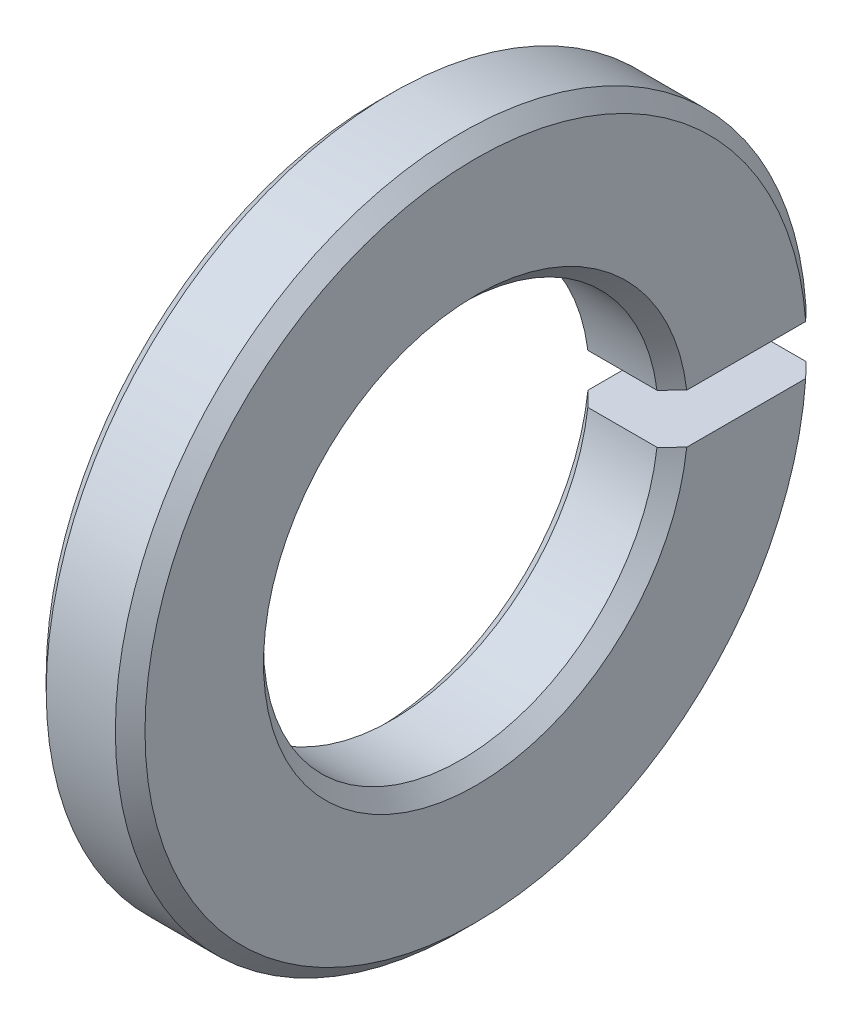
ISO-10303-21;
HEADER;
FILE_DESCRIPTION(('STEP AP214'),'2;1');
FILE_NAME('part.step','',(''),(''),'','','');
FILE_SCHEMA(('AUTOMOTIVE_DESIGN { 1 0 10303 214 1 1 1 1 }'));
ENDSEC;
DATA;
#1=APPLICATION_CONTEXT('core data for automotive mechanical design processes');
#2=APPLICATION_PROTOCOL_DEFINITION('international standard','automotive_design',2000,#1);
#3=PRODUCT_CONTEXT('',#1,'mechanical');
#4=PRODUCT('Part','Part','',(#3));
#5=PRODUCT_RELATED_PRODUCT_CATEGORY('part','',(#4));
#6=PRODUCT_DEFINITION_FORMATION('','',#4);
#7=PRODUCT_DEFINITION_CONTEXT('part definition',#1,'design');
#8=PRODUCT_DEFINITION('design','',#6,#7);
#9=PRODUCT_DEFINITION_SHAPE('','',#8);
#10=(LENGTH_UNIT() NAMED_UNIT(*) SI_UNIT(.MILLI.,.METRE.));
#11=(NAMED_UNIT(*) PLANE_ANGLE_UNIT() SI_UNIT($,.RADIAN.));
#12=(NAMED_UNIT(*) SI_UNIT($,.STERADIAN.) SOLID_ANGLE_UNIT());
#13=UNCERTAINTY_MEASURE_WITH_UNIT(LENGTH_MEASURE(1.E-05),#10,'distance_accuracy_value','');
#14=(GEOMETRIC_REPRESENTATION_CONTEXT(3) GLOBAL_UNCERTAINTY_ASSIGNED_CONTEXT((#13)) GLOBAL_UNIT_ASSIGNED_CONTEXT((#10,
#11,#12)) REPRESENTATION_CONTEXT('',''));
#15=CARTESIAN_POINT('',(0.,0.,0.));
#16=DIRECTION('',(0.,0.,1.));
#17=DIRECTION('',(1.,0.,0.));
#18=AXIS2_PLACEMENT_3D('',#15,#16,#17);
#19=CARTESIAN_POINT('',(2.,0.,0.));
#20=DIRECTION('',(-1.,0.,0.));
#21=DIRECTION('',(0.,0.,1.));
#22=AXIS2_PLACEMENT_3D('',#19,#20,#21);
#23=CYLINDRICAL_SURFACE('',#22,7.);
#24=DIRECTION('',(-1.,0.,0.));
#25=VECTOR('',#24,1.);
#26=CARTESIAN_POINT('',(2.,0.5,-6.98212002188447));
#27=LINE('',#26,#25);
#28=CARTESIAN_POINT('',(1.7,0.5,-6.98212002188447));
#29=VERTEX_POINT('',#28);
#30=CARTESIAN_POINT('',(0.300000000000002,0.5,-6.98212002188447));
#31=VERTEX_POINT('',#30);
#32=EDGE_CURVE('E123',#29,#31,#27,.T.);
#33=ORIENTED_EDGE('',*,*,#32,.T.);
#34=CARTESIAN_POINT('',(0.300000000000002,0.,0.));
#35=DIRECTION('',(1.,0.,0.));
#36=DIRECTION('',(0.,0.,-1.));
#37=AXIS2_PLACEMENT_3D('',#34,#35,#36);
#38=CIRCLE('',#37,7.);
#39=CARTESIAN_POINT('',(0.300000000000002,-0.5,-6.98212002188447));
#40=VERTEX_POINT('',#39);
#41=EDGE_CURVE('E11',#31,#40,#38,.T.);
#42=ORIENTED_EDGE('',*,*,#41,.T.);
#43=DIRECTION('',(-1.,0.,0.));
#44=VECTOR('',#43,1.);
#45=CARTESIAN_POINT('',(2.,-0.5,-6.98212002188447));
#46=LINE('',#45,#44);
#47=CARTESIAN_POINT('',(1.7,-0.5,-6.98212002188447));
#48=VERTEX_POINT('',#47);
#49=EDGE_CURVE('E128',#48,#40,#46,.T.);
#50=ORIENTED_EDGE('',*,*,#49,.F.);
#51=CARTESIAN_POINT('',(1.7,0.,0.));
#52=DIRECTION('',(1.,0.,0.));
#53=DIRECTION('',(0.,0.,-1.));
#54=AXIS2_PLACEMENT_3D('',#51,#52,#53);
#55=CIRCLE('',#54,7.);
#56=EDGE_CURVE('E43',#48,#29,#55,.F.);
#57=ORIENTED_EDGE('',*,*,#56,.T.);
#58=EDGE_LOOP('',(#33,#42,#50,#57));
#59=FACE_BOUND('',#58,.T.);
#60=ADVANCED_FACE('F34',(#59),#23,.T.);
#61=CARTESIAN_POINT('',(2.,-0.5,-3.96862696659689));
#62=DIRECTION('',(0.,-1.,0.));
#63=DIRECTION('',(0.,0.,-1.));
#64=AXIS2_PLACEMENT_3D('',#61,#62,#63);
#65=PLANE('',#64);
#66=DIRECTION('',(0.,0.,1.));
#67=VECTOR('',#66,1.);
#68=CARTESIAN_POINT('',(0.,-0.5,-3.96862696659689));
#69=LINE('',#68,#67);
#70=CARTESIAN_POINT('',(0.,-0.5,-6.68131723539602));
#71=VERTEX_POINT('',#70);
#72=CARTESIAN_POINT('',(0.,-0.5,-4.27083130081253));
#73=VERTEX_POINT('',#72);
#74=EDGE_CURVE('E217',#71,#73,#69,.T.);
#75=ORIENTED_EDGE('',*,*,#74,.T.);
#76=CARTESIAN_POINT('',(0.,-0.5,-4.27083130081253));
#77=CARTESIAN_POINT('',(0.0500134254469497,-0.5,-4.22047723936005));
#78=CARTESIAN_POINT('',(0.100020138154378,-0.5,-4.17011651413202));
#79=CARTESIAN_POINT('',(0.200020138154396,-0.5,-4.06938173606015));
#80=CARTESIAN_POINT('',(0.250013425446968,-0.5,-4.01900768321631));
#81=CARTESIAN_POINT('',(0.300000000000001,-0.5,-3.96862696659689));
#82=B_SPLINE_CURVE_WITH_KNOTS('',3,(#76,#77,#78,#79,#80,#81),.UNSPECIFIED.,.F.,.F.,(4,2,4),(0.,
0.212912812323901,0.425825624921191),.UNSPECIFIED.);
#83=CARTESIAN_POINT('',(0.300000000000002,-0.5,-3.96862696659689));
#84=VERTEX_POINT('',#83);
#85=EDGE_CURVE('E183',#73,#84,#82,.T.);
#86=ORIENTED_EDGE('',*,*,#85,.T.);
#87=DIRECTION('',(-1.,0.,0.));
#88=VECTOR('',#87,1.);
#89=CARTESIAN_POINT('',(2.,-0.5,-3.96862696659689));
#90=LINE('',#89,#88);
#91=CARTESIAN_POINT('',(1.7,-0.5,-3.96862696659689));
#92=VERTEX_POINT('',#91);
#93=EDGE_CURVE('E122',#92,#84,#90,.T.);
#94=ORIENTED_EDGE('',*,*,#93,.F.);
#95=CARTESIAN_POINT('',(1.7,-0.5,-3.96862696659689));
#96=CARTESIAN_POINT('',(1.74998657455303,-0.5,-4.01900768321631));
#97=CARTESIAN_POINT('',(1.79997986184561,-0.5,-4.06938173606015));
#98=CARTESIAN_POINT('',(1.89997986184562,-0.5,-4.17011651413201));
#99=CARTESIAN_POINT('',(1.94998657455305,-0.5,-4.22047723936005));
#100=CARTESIAN_POINT('',(2.,-0.5,-4.27083130081252));
#101=B_SPLINE_CURVE_WITH_KNOTS('',3,(#95,#96,#97,#98,#99,#100),.UNSPECIFIED.,.F.,.F.,(4,2,4),
(0.,0.212912812597288,0.425825624921187),.UNSPECIFIED.);
#102=CARTESIAN_POINT('',(2.,-0.5,-4.27083130081252));
#103=VERTEX_POINT('',#102);
#104=EDGE_CURVE('E127',#92,#103,#101,.T.);
#105=ORIENTED_EDGE('',*,*,#104,.T.);
#106=DIRECTION('',(0.,0.,1.));
#107=VECTOR('',#106,1.);
#108=CARTESIAN_POINT('',(2.,-0.5,-3.96862696659689));
#109=LINE('',#108,#107);
#110=CARTESIAN_POINT('',(2.,-0.5,-6.68131723539603));
#111=VERTEX_POINT('',#110);
#112=EDGE_CURVE('E216',#111,#103,#109,.T.);
#113=ORIENTED_EDGE('',*,*,#112,.F.);
#114=CARTESIAN_POINT('',(2.,-0.5,-6.68131723539603));
#115=CARTESIAN_POINT('',(1.95000294163708,-0.5,-6.73145396693238));
#116=CARTESIAN_POINT('',(1.90000441245514,-0.5,-6.78158923157507));
#117=CARTESIAN_POINT('',(1.80000441245514,-0.5,-6.88185682707122));
#118=CARTESIAN_POINT('',(1.75000294163708,-0.5,-6.93198915792468));
#119=CARTESIAN_POINT('',(1.7,-0.5,-6.98212002188447));
#120=B_SPLINE_CURVE_WITH_KNOTS('',3,(#114,#115,#116,#117,#118,#119),.UNSPECIFIED.,.F.,.F.,(4,2,
4),(0.,0.212416051960155,0.424832103912301),.UNSPECIFIED.);
#121=EDGE_CURVE('E57',#111,#48,#120,.T.);
#122=ORIENTED_EDGE('',*,*,#121,.T.);
#123=ORIENTED_EDGE('',*,*,#49,.T.);
#124=CARTESIAN_POINT('',(0.300000000000002,-0.5,-6.98212002188447));
#125=CARTESIAN_POINT('',(0.249997058362927,-0.5,-6.93198915792468));
#126=CARTESIAN_POINT('',(0.19999558754486,-0.5,-6.88185682707121));
#127=CARTESIAN_POINT('',(0.0999955875448593,-0.5,-6.78158923157507));
#128=CARTESIAN_POINT('',(0.0499970583629252,-0.5,-6.73145396693238));
#129=CARTESIAN_POINT('',(0.,-0.5,-6.68131723539602));
#130=B_SPLINE_CURVE_WITH_KNOTS('',3,(#124,#125,#126,#127,#128,#129),.UNSPECIFIED.,.F.,.F.,(4,2,
4),(0.,0.21241605195215,0.424832103912309),.UNSPECIFIED.);
#131=EDGE_CURVE('E50',#40,#71,#130,.T.);
#132=ORIENTED_EDGE('',*,*,#131,.T.);
#133=EDGE_LOOP('',(#75,#86,#94,#105,#113,#122,#123,#132));
#134=FACE_BOUND('',#133,.T.);
#135=ADVANCED_FACE('F194',(#134),#65,.F.);
#136=CARTESIAN_POINT('',(2.,0.,0.));
#137=DIRECTION('',(-1.,0.,0.));
#138=DIRECTION('',(0.,0.,1.));
#139=AXIS2_PLACEMENT_3D('',#136,#137,#138);
#140=CYLINDRICAL_SURFACE('',#139,4.);
#141=ORIENTED_EDGE('',*,*,#93,.T.);
#142=CARTESIAN_POINT('',(0.300000000000002,0.,0.));
#143=DIRECTION('',(1.,0.,0.));
#144=DIRECTION('',(0.,0.,-1.));
#145=AXIS2_PLACEMENT_3D('',#142,#143,#144);
#146=CIRCLE('',#145,4.);
#147=CARTESIAN_POINT('',(0.300000000000002,0.5,-3.96862696659689));
#148=VERTEX_POINT('',#147);
#149=EDGE_CURVE('E121',#84,#148,#146,.F.);
#150=ORIENTED_EDGE('',*,*,#149,.T.);
#151=DIRECTION('',(-1.,0.,0.));
#152=VECTOR('',#151,1.);
#153=CARTESIAN_POINT('',(2.,0.5,-3.96862696659689));
#154=LINE('',#153,#152);
#155=CARTESIAN_POINT('',(1.7,0.5,-3.96862696659689));
#156=VERTEX_POINT('',#155);
#157=EDGE_CURVE('E104',#156,#148,#154,.T.);
#158=ORIENTED_EDGE('',*,*,#157,.F.);
#159=CARTESIAN_POINT('',(1.7,0.,0.));
#160=DIRECTION('',(1.,0.,0.));
#161=DIRECTION('',(0.,0.,-1.));
#162=AXIS2_PLACEMENT_3D('',#159,#160,#161);
#163=CIRCLE('',#162,4.);
#164=EDGE_CURVE('E118',#156,#92,#163,.T.);
#165=ORIENTED_EDGE('',*,*,#164,.T.);
#166=EDGE_LOOP('',(#141,#150,#158,#165));
#167=FACE_BOUND('',#166,.T.);
#168=ADVANCED_FACE('F117',(#167),#140,.F.);
#169=CARTESIAN_POINT('',(2.,0.5,-3.96862696659689));
#170=DIRECTION('',(0.,1.,0.));
#171=DIRECTION('',(0.,0.,1.));
#172=AXIS2_PLACEMENT_3D('',#169,#170,#171);
#173=PLANE('',#172);
#174=ORIENTED_EDGE('',*,*,#157,.T.);
#175=CARTESIAN_POINT('',(0.300000000000002,0.5,-3.96862696659689));
#176=CARTESIAN_POINT('',(0.250013425446968,0.5,-4.01900768321631));
#177=CARTESIAN_POINT('',(0.200020138154396,0.5,-4.06938173606015));
#178=CARTESIAN_POINT('',(0.100020138154378,0.5,-4.17011651413202));
#179=CARTESIAN_POINT('',(0.0500134254469496,0.5,-4.22047723936005));
#180=CARTESIAN_POINT('',(0.,0.5,-4.27083130081253));
#181=B_SPLINE_CURVE_WITH_KNOTS('',3,(#175,#176,#177,#178,#179,#180),.UNSPECIFIED.,.F.,.F.,(4,2,
4),(0.,0.21291281259729,0.425825624921192),.UNSPECIFIED.);
#182=CARTESIAN_POINT('',(0.,0.5,-4.27083130081253));
#183=VERTEX_POINT('',#182);
#184=EDGE_CURVE('E111',#148,#183,#181,.T.);
#185=ORIENTED_EDGE('',*,*,#184,.T.);
#186=DIRECTION('',(0.,0.,-1.));
#187=VECTOR('',#186,1.);
#188=CARTESIAN_POINT('',(0.,0.5,-3.96862696659689));
#189=LINE('',#188,#187);
#190=CARTESIAN_POINT('',(0.,0.5,-6.68131723539602));
#191=VERTEX_POINT('',#190);
#192=EDGE_CURVE('E211',#183,#191,#189,.T.);
#193=ORIENTED_EDGE('',*,*,#192,.T.);
#194=CARTESIAN_POINT('',(0.,0.5,-6.68131723539602));
#195=CARTESIAN_POINT('',(0.0499970583629254,0.5,-6.73145396693238));
#196=CARTESIAN_POINT('',(0.0999955875448595,0.5,-6.78158923157507));
#197=CARTESIAN_POINT('',(0.19999558754486,0.5,-6.88185682707121));
#198=CARTESIAN_POINT('',(0.249997058362927,0.5,-6.93198915792468));
#199=CARTESIAN_POINT('',(0.300000000000002,0.5,-6.98212002188447));
#200=B_SPLINE_CURVE_WITH_KNOTS('',3,(#194,#195,#196,#197,#198,#199),.UNSPECIFIED.,.F.,.F.,(4,2,
4),(0.,0.212416051960158,0.424832103912309),.UNSPECIFIED.);
#201=EDGE_CURVE('E112',#191,#31,#200,.T.);
#202=ORIENTED_EDGE('',*,*,#201,.T.);
#203=ORIENTED_EDGE('',*,*,#32,.F.);
#204=CARTESIAN_POINT('',(1.7,0.5,-6.98212002188447));
#205=CARTESIAN_POINT('',(1.75000294163708,0.5,-6.93198915792468));
#206=CARTESIAN_POINT('',(1.80000441245514,0.5,-6.88185682707122));
#207=CARTESIAN_POINT('',(1.90000441245514,0.5,-6.78158923157507));
#208=CARTESIAN_POINT('',(1.95000294163708,0.5,-6.73145396693238));
#209=CARTESIAN_POINT('',(2.,0.5,-6.68131723539603));
#210=B_SPLINE_CURVE_WITH_KNOTS('',3,(#204,#205,#206,#207,#208,#209),.UNSPECIFIED.,.F.,.F.,(4,2,
4),(0.,0.212416051952147,0.424832103912302),.UNSPECIFIED.);
#211=CARTESIAN_POINT('',(2.,0.5,-6.68131723539603));
#212=VERTEX_POINT('',#211);
#213=EDGE_CURVE('E130',#29,#212,#210,.T.);
#214=ORIENTED_EDGE('',*,*,#213,.T.);
#215=DIRECTION('',(0.,0.,-1.));
#216=VECTOR('',#215,1.);
#217=CARTESIAN_POINT('',(2.,0.5,-3.96862696659689));
#218=LINE('',#217,#216);
#219=CARTESIAN_POINT('',(2.,0.5,-4.27083130081252));
#220=VERTEX_POINT('',#219);
#221=EDGE_CURVE('E106',#220,#212,#218,.T.);
#222=ORIENTED_EDGE('',*,*,#221,.F.);
#223=CARTESIAN_POINT('',(2.,0.5,-4.27083130081252));
#224=CARTESIAN_POINT('',(1.94998657455305,0.5,-4.22047723936005));
#225=CARTESIAN_POINT('',(1.89997986184562,0.5,-4.17011651413201));
#226=CARTESIAN_POINT('',(1.79997986184561,0.5,-4.06938173606015));
#227=CARTESIAN_POINT('',(1.74998657455304,0.5,-4.01900768321631));
#228=CARTESIAN_POINT('',(1.7,0.5,-3.96862696659689));
#229=B_SPLINE_CURVE_WITH_KNOTS('',3,(#223,#224,#225,#226,#227,#228),.UNSPECIFIED.,.F.,.F.,(4,2,
4),(0.,0.212912812323899,0.425825624921186),.UNSPECIFIED.);
#230=EDGE_CURVE('E101',#220,#156,#229,.T.);
#231=ORIENTED_EDGE('',*,*,#230,.T.);
#232=EDGE_LOOP('',(#174,#185,#193,#202,#203,#214,#222,#231));
#233=FACE_BOUND('',#232,.T.);
#234=ADVANCED_FACE('F103',(#233),#173,.F.);
#235=CARTESIAN_POINT('',(2.,0.,0.));
#236=DIRECTION('',(1.,0.,0.));
#237=DIRECTION('',(0.,0.,-1.));
#238=AXIS2_PLACEMENT_3D('',#235,#236,#237);
#239=PLANE('',#238);
#240=ORIENTED_EDGE('',*,*,#112,.T.);
#241=CARTESIAN_POINT('',(2.,0.,0.));
#242=DIRECTION('',(1.,0.,0.));
#243=DIRECTION('',(0.,0.,-1.));
#244=AXIS2_PLACEMENT_3D('',#241,#242,#243);
#245=CIRCLE('',#244,4.3);
#246=EDGE_CURVE('E222',#103,#220,#245,.F.);
#247=ORIENTED_EDGE('',*,*,#246,.T.);
#248=ORIENTED_EDGE('',*,*,#221,.T.);
#249=CARTESIAN_POINT('',(2.,0.,0.));
#250=DIRECTION('',(1.,0.,0.));
#251=DIRECTION('',(0.,0.,-1.));
#252=AXIS2_PLACEMENT_3D('',#249,#250,#251);
#253=CIRCLE('',#252,6.7);
#254=EDGE_CURVE('E220',#212,#111,#253,.T.);
#255=ORIENTED_EDGE('',*,*,#254,.T.);
#256=EDGE_LOOP('',(#240,#247,#248,#255));
#257=FACE_BOUND('',#256,.T.);
#258=ADVANCED_FACE('F149',(#257),#239,.T.);
#259=CARTESIAN_POINT('',(0.,0.,0.));
#260=DIRECTION('',(1.,0.,0.));
#261=DIRECTION('',(0.,0.,-1.));
#262=AXIS2_PLACEMENT_3D('',#259,#260,#261);
#263=PLANE('',#262);
#264=ORIENTED_EDGE('',*,*,#192,.F.);
#265=CARTESIAN_POINT('',(0.,0.,0.));
#266=DIRECTION('',(1.,0.,0.));
#267=DIRECTION('',(0.,0.,-1.));
#268=AXIS2_PLACEMENT_3D('',#265,#266,#267);
#269=CIRCLE('',#268,4.3);
#270=EDGE_CURVE('E205',#183,#73,#269,.T.);
#271=ORIENTED_EDGE('',*,*,#270,.T.);
#272=ORIENTED_EDGE('',*,*,#74,.F.);
#273=CARTESIAN_POINT('',(0.,0.,0.));
#274=DIRECTION('',(1.,0.,0.));
#275=DIRECTION('',(0.,0.,-1.));
#276=AXIS2_PLACEMENT_3D('',#273,#274,#275);
#277=CIRCLE('',#276,6.7);
#278=EDGE_CURVE('E206',#71,#191,#277,.F.);
#279=ORIENTED_EDGE('',*,*,#278,.T.);
#280=EDGE_LOOP('',(#264,#271,#272,#279));
#281=FACE_BOUND('',#280,.T.);
#282=ADVANCED_FACE('F150',(#281),#263,.F.);
#283=CARTESIAN_POINT('',(0.300000000000002,0.,0.));
#284=DIRECTION('',(-1.,0.,0.));
#285=DIRECTION('',(0.,0.,1.));
#286=AXIS2_PLACEMENT_3D('',#283,#284,#285);
#287=CONICAL_SURFACE('',#286,4.,0.785398163397448);
#288=ORIENTED_EDGE('',*,*,#85,.F.);
#289=ORIENTED_EDGE('',*,*,#270,.F.);
#290=ORIENTED_EDGE('',*,*,#184,.F.);
#291=ORIENTED_EDGE('',*,*,#149,.F.);
#292=EDGE_LOOP('',(#288,#289,#290,#291));
#293=FACE_BOUND('',#292,.T.);
#294=ADVANCED_FACE('F171',(#293),#287,.F.);
#295=CARTESIAN_POINT('',(2.,0.,0.));
#296=DIRECTION('',(1.,0.,0.));
#297=DIRECTION('',(0.,0.,-1.));
#298=AXIS2_PLACEMENT_3D('',#295,#296,#297);
#299=CONICAL_SURFACE('',#298,4.3,0.785398163397448);
#300=ORIENTED_EDGE('',*,*,#104,.F.);
#301=ORIENTED_EDGE('',*,*,#164,.F.);
#302=ORIENTED_EDGE('',*,*,#230,.F.);
#303=ORIENTED_EDGE('',*,*,#246,.F.);
#304=EDGE_LOOP('',(#300,#301,#302,#303));
#305=FACE_BOUND('',#304,.T.);
#306=ADVANCED_FACE('F126',(#305),#299,.F.);
#307=CARTESIAN_POINT('',(0.300000000000002,0.,0.));
#308=DIRECTION('',(1.,0.,0.));
#309=DIRECTION('',(0.,0.,-1.));
#310=AXIS2_PLACEMENT_3D('',#307,#308,#309);
#311=CONICAL_SURFACE('',#310,7.,0.785398163397451);
#312=ORIENTED_EDGE('',*,*,#201,.F.);
#313=ORIENTED_EDGE('',*,*,#278,.F.);
#314=ORIENTED_EDGE('',*,*,#131,.F.);
#315=ORIENTED_EDGE('',*,*,#41,.F.);
#316=EDGE_LOOP('',(#312,#313,#314,#315));
#317=FACE_BOUND('',#316,.T.);
#318=ADVANCED_FACE('F170',(#317),#311,.T.);
#319=CARTESIAN_POINT('',(2.,0.,0.));
#320=DIRECTION('',(-1.,0.,0.));
#321=DIRECTION('',(0.,0.,1.));
#322=AXIS2_PLACEMENT_3D('',#319,#320,#321);
#323=CONICAL_SURFACE('',#322,6.7,0.785398163397446);
#324=ORIENTED_EDGE('',*,*,#213,.F.);
#325=ORIENTED_EDGE('',*,*,#56,.F.);
#326=ORIENTED_EDGE('',*,*,#121,.F.);
#327=ORIENTED_EDGE('',*,*,#254,.F.);
#328=EDGE_LOOP('',(#324,#325,#326,#327));
#329=FACE_BOUND('',#328,.T.);
#330=ADVANCED_FACE('F36',(#329),#323,.T.);
#331=CLOSED_SHELL('',(#60,#135,#168,#234,#258,#282,#294,#306,#318,#330));
#332=MANIFOLD_SOLID_BREP('B2',#331);
#333=ADVANCED_BREP_SHAPE_REPRESENTATION('',(#18,#332),#14);
#334=SHAPE_DEFINITION_REPRESENTATION(#9,#333);
ENDSEC;
END-ISO-10303-21;
